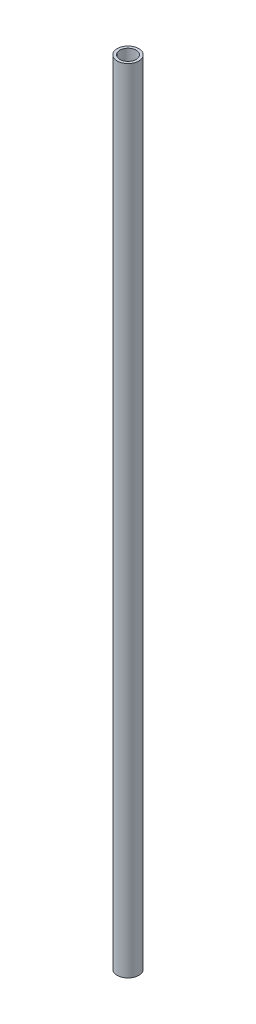
ISO-10303-21;
HEADER;
FILE_DESCRIPTION(('STEP AP214'),'2;1');
FILE_NAME('part.step','',(''),(''),'','','');
FILE_SCHEMA(('AUTOMOTIVE_DESIGN { 1 0 10303 214 1 1 1 1 }'));
ENDSEC;
DATA;
#1=APPLICATION_CONTEXT('core data for automotive mechanical design processes');
#2=APPLICATION_PROTOCOL_DEFINITION('international standard','automotive_design',2000,#1);
#3=PRODUCT_CONTEXT('',#1,'mechanical');
#4=PRODUCT('Part','Part','',(#3));
#5=PRODUCT_RELATED_PRODUCT_CATEGORY('part','',(#4));
#6=PRODUCT_DEFINITION_FORMATION('','',#4);
#7=PRODUCT_DEFINITION_CONTEXT('part definition',#1,'design');
#8=PRODUCT_DEFINITION('design','',#6,#7);
#9=PRODUCT_DEFINITION_SHAPE('','',#8);
#10=(LENGTH_UNIT() NAMED_UNIT(*) SI_UNIT(.MILLI.,.METRE.));
#11=(NAMED_UNIT(*) PLANE_ANGLE_UNIT() SI_UNIT($,.RADIAN.));
#12=(NAMED_UNIT(*) SI_UNIT($,.STERADIAN.) SOLID_ANGLE_UNIT());
#13=UNCERTAINTY_MEASURE_WITH_UNIT(LENGTH_MEASURE(1.E-05),#10,'distance_accuracy_value','');
#14=(GEOMETRIC_REPRESENTATION_CONTEXT(3) GLOBAL_UNCERTAINTY_ASSIGNED_CONTEXT((#13)) GLOBAL_UNIT_ASSIGNED_CONTEXT((#10,
#11,#12)) REPRESENTATION_CONTEXT('',''));
#15=CARTESIAN_POINT('',(0.,0.,0.));
#16=DIRECTION('',(0.,0.,1.));
#17=DIRECTION('',(1.,0.,0.));
#18=AXIS2_PLACEMENT_3D('',#15,#16,#17);
#19=CARTESIAN_POINT('',(0.,73.5,0.));
#20=DIRECTION('',(0.,1.,0.));
#21=DIRECTION('',(0.,0.,1.));
#22=AXIS2_PLACEMENT_3D('',#19,#20,#21);
#23=PLANE('',#22);
#24=CARTESIAN_POINT('',(0.,73.5,0.));
#25=DIRECTION('',(0.,1.,0.));
#26=DIRECTION('',(0.,0.,1.));
#27=AXIS2_PLACEMENT_3D('',#24,#25,#26);
#28=CIRCLE('',#27,2.);
#29=CARTESIAN_POINT('',(0.,73.5,2.));
#30=VERTEX_POINT('',#29);
#31=EDGE_CURVE('E10',#30,#30,#28,.T.);
#32=ORIENTED_EDGE('',*,*,#31,.T.);
#33=EDGE_LOOP('',(#32));
#34=FACE_BOUND('',#33,.T.);
#35=CARTESIAN_POINT('',(0.,73.5,0.));
#36=DIRECTION('',(0.,1.,0.));
#37=DIRECTION('',(0.,0.,1.));
#38=AXIS2_PLACEMENT_3D('',#35,#36,#37);
#39=CIRCLE('',#38,1.5);
#40=CARTESIAN_POINT('',(0.,73.5,1.5));
#41=VERTEX_POINT('',#40);
#42=EDGE_CURVE('E45',#41,#41,#39,.T.);
#43=ORIENTED_EDGE('',*,*,#42,.F.);
#44=EDGE_LOOP('',(#43));
#45=FACE_BOUND('',#44,.T.);
#46=ADVANCED_FACE('F34',(#34,#45),#23,.T.);
#47=CARTESIAN_POINT('',(0.,-73.5,0.));
#48=DIRECTION('',(0.,1.,0.));
#49=DIRECTION('',(0.,0.,1.));
#50=AXIS2_PLACEMENT_3D('',#47,#48,#49);
#51=PLANE('',#50);
#52=CARTESIAN_POINT('',(0.,-73.5,0.));
#53=DIRECTION('',(0.,1.,0.));
#54=DIRECTION('',(0.,0.,1.));
#55=AXIS2_PLACEMENT_3D('',#52,#53,#54);
#56=CIRCLE('',#55,2.);
#57=CARTESIAN_POINT('',(0.,-73.5,2.));
#58=VERTEX_POINT('',#57);
#59=EDGE_CURVE('E38',#58,#58,#56,.T.);
#60=ORIENTED_EDGE('',*,*,#59,.F.);
#61=EDGE_LOOP('',(#60));
#62=FACE_BOUND('',#61,.T.);
#63=CARTESIAN_POINT('',(0.,-73.5,0.));
#64=DIRECTION('',(0.,1.,0.));
#65=DIRECTION('',(0.,0.,1.));
#66=AXIS2_PLACEMENT_3D('',#63,#64,#65);
#67=CIRCLE('',#66,1.5);
#68=CARTESIAN_POINT('',(0.,-73.5,1.5));
#69=VERTEX_POINT('',#68);
#70=EDGE_CURVE('E47',#69,#69,#67,.T.);
#71=ORIENTED_EDGE('',*,*,#70,.T.);
#72=EDGE_LOOP('',(#71));
#73=FACE_BOUND('',#72,.T.);
#74=ADVANCED_FACE('F57',(#62,#73),#51,.F.);
#75=CARTESIAN_POINT('',(0.,73.5,0.));
#76=DIRECTION('',(0.,-1.,0.));
#77=DIRECTION('',(0.,0.,-1.));
#78=AXIS2_PLACEMENT_3D('',#75,#76,#77);
#79=CYLINDRICAL_SURFACE('',#78,2.);
#80=ORIENTED_EDGE('',*,*,#31,.F.);
#81=EDGE_LOOP('',(#80));
#82=FACE_BOUND('',#81,.T.);
#83=ORIENTED_EDGE('',*,*,#59,.T.);
#84=EDGE_LOOP('',(#83));
#85=FACE_BOUND('',#84,.T.);
#86=ADVANCED_FACE('F36',(#82,#85),#79,.T.);
#87=CARTESIAN_POINT('',(0.,73.5,0.));
#88=DIRECTION('',(0.,-1.,0.));
#89=DIRECTION('',(0.,0.,-1.));
#90=AXIS2_PLACEMENT_3D('',#87,#88,#89);
#91=CYLINDRICAL_SURFACE('',#90,1.5);
#92=ORIENTED_EDGE('',*,*,#42,.T.);
#93=EDGE_LOOP('',(#92));
#94=FACE_BOUND('',#93,.T.);
#95=ORIENTED_EDGE('',*,*,#70,.F.);
#96=EDGE_LOOP('',(#95));
#97=FACE_BOUND('',#96,.T.);
#98=ADVANCED_FACE('F53',(#94,#97),#91,.F.);
#99=CLOSED_SHELL('',(#46,#74,#86,#98));
#100=MANIFOLD_SOLID_BREP('B2',#99);
#101=ADVANCED_BREP_SHAPE_REPRESENTATION('',(#18,#100),#14);
#102=SHAPE_DEFINITION_REPRESENTATION(#9,#101);
ENDSEC;
END-ISO-10303-21;
